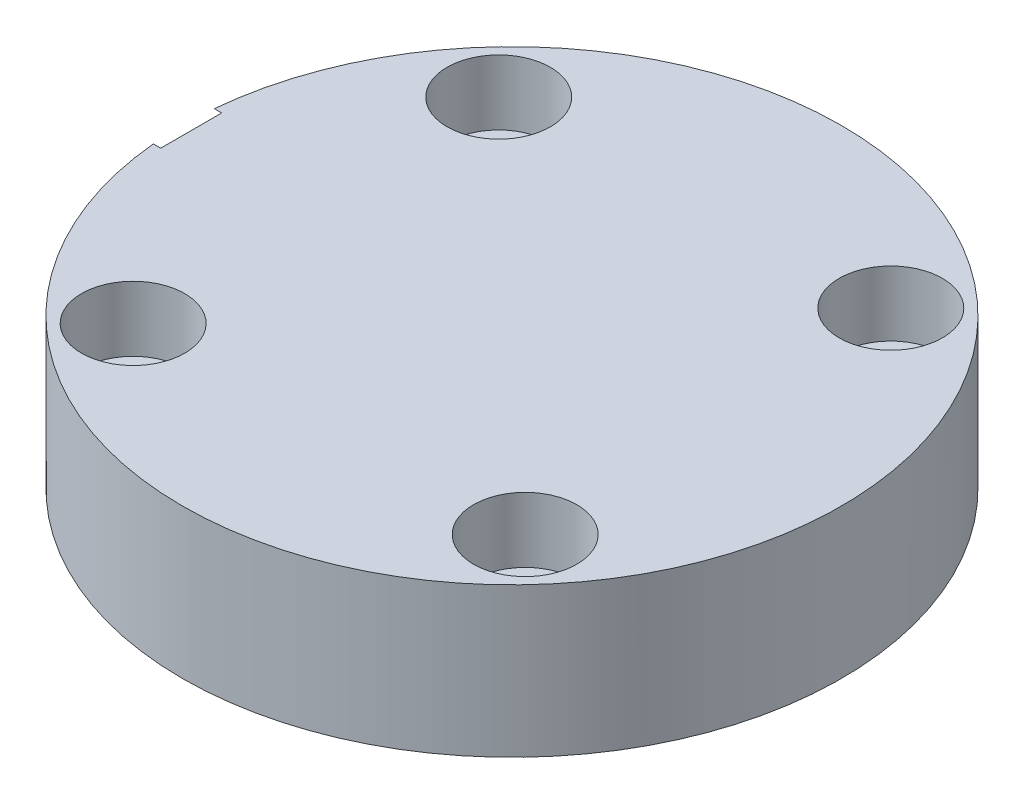
ISO-10303-21;
HEADER;
FILE_DESCRIPTION(('STEP AP214'),'2;1');
FILE_NAME('part.step','',(''),(''),'','','');
FILE_SCHEMA(('AUTOMOTIVE_DESIGN { 1 0 10303 214 1 1 1 1 }'));
ENDSEC;
DATA;
#1=APPLICATION_CONTEXT('core data for automotive mechanical design processes');
#2=APPLICATION_PROTOCOL_DEFINITION('international standard','automotive_design',2000,#1);
#3=PRODUCT_CONTEXT('',#1,'mechanical');
#4=PRODUCT('Part','Part','',(#3));
#5=PRODUCT_RELATED_PRODUCT_CATEGORY('part','',(#4));
#6=PRODUCT_DEFINITION_FORMATION('','',#4);
#7=PRODUCT_DEFINITION_CONTEXT('part definition',#1,'design');
#8=PRODUCT_DEFINITION('design','',#6,#7);
#9=PRODUCT_DEFINITION_SHAPE('','',#8);
#10=(LENGTH_UNIT() NAMED_UNIT(*) SI_UNIT(.MILLI.,.METRE.));
#11=(NAMED_UNIT(*) PLANE_ANGLE_UNIT() SI_UNIT($,.RADIAN.));
#12=(NAMED_UNIT(*) SI_UNIT($,.STERADIAN.) SOLID_ANGLE_UNIT());
#13=UNCERTAINTY_MEASURE_WITH_UNIT(LENGTH_MEASURE(1.E-05),#10,'distance_accuracy_value','');
#14=(GEOMETRIC_REPRESENTATION_CONTEXT(3) GLOBAL_UNCERTAINTY_ASSIGNED_CONTEXT((#13)) GLOBAL_UNIT_ASSIGNED_CONTEXT((#10,
#11,#12)) REPRESENTATION_CONTEXT('',''));
#15=CARTESIAN_POINT('',(0.,0.,0.));
#16=DIRECTION('',(0.,0.,1.));
#17=DIRECTION('',(1.,0.,0.));
#18=AXIS2_PLACEMENT_3D('',#15,#16,#17);
#19=CARTESIAN_POINT('',(0.,8.636,0.));
#20=DIRECTION('',(0.,-1.,0.));
#21=DIRECTION('',(0.,0.,-1.));
#22=AXIS2_PLACEMENT_3D('',#19,#20,#21);
#23=PLANE('',#22);
#24=CARTESIAN_POINT('',(-11.331594252887,8.636,-10.566882590808));
#25=DIRECTION('',(0.,1.,0.));
#26=DIRECTION('',(0.,0.,1.));
#27=AXIS2_PLACEMENT_3D('',#24,#25,#26);
#28=CIRCLE('',#27,2.98450000000001);
#29=CARTESIAN_POINT('',(-11.331594252887,8.636,-7.58238259080798));
#30=VERTEX_POINT('',#29);
#31=EDGE_CURVE('E101',#30,#30,#28,.T.);
#32=ORIENTED_EDGE('',*,*,#31,.F.);
#33=EDGE_LOOP('',(#32));
#34=FACE_BOUND('',#33,.T.);
#35=CARTESIAN_POINT('',(10.566882590808,8.636,-11.331594252887));
#36=DIRECTION('',(0.,1.,0.));
#37=DIRECTION('',(0.,0.,1.));
#38=AXIS2_PLACEMENT_3D('',#35,#36,#37);
#39=CIRCLE('',#38,2.98450000000001);
#40=CARTESIAN_POINT('',(10.566882590808,8.636,-8.34709425288698));
#41=VERTEX_POINT('',#40);
#42=EDGE_CURVE('E116',#41,#41,#39,.T.);
#43=ORIENTED_EDGE('',*,*,#42,.F.);
#44=EDGE_LOOP('',(#43));
#45=FACE_BOUND('',#44,.T.);
#46=CARTESIAN_POINT('',(11.331594252887,8.636,10.566882590808));
#47=DIRECTION('',(0.,1.,0.));
#48=DIRECTION('',(0.,0.,1.));
#49=AXIS2_PLACEMENT_3D('',#46,#47,#48);
#50=CIRCLE('',#49,2.98450000000001);
#51=CARTESIAN_POINT('',(11.331594252887,8.636,13.551382590808));
#52=VERTEX_POINT('',#51);
#53=EDGE_CURVE('E128',#52,#52,#50,.T.);
#54=ORIENTED_EDGE('',*,*,#53,.F.);
#55=EDGE_LOOP('',(#54));
#56=FACE_BOUND('',#55,.T.);
#57=CARTESIAN_POINT('',(-10.566882590808,8.636,11.331594252887));
#58=DIRECTION('',(0.,1.,0.));
#59=DIRECTION('',(0.,0.,1.));
#60=AXIS2_PLACEMENT_3D('',#57,#58,#59);
#61=CIRCLE('',#60,2.98450000000001);
#62=CARTESIAN_POINT('',(-10.566882590808,8.636,14.316094252887));
#63=VERTEX_POINT('',#62);
#64=EDGE_CURVE('E140',#63,#63,#61,.T.);
#65=ORIENTED_EDGE('',*,*,#64,.F.);
#66=EDGE_LOOP('',(#65));
#67=FACE_BOUND('',#66,.T.);
#68=DIRECTION('',(-1.,0.,0.));
#69=VECTOR('',#68,1.);
#70=CARTESIAN_POINT('',(-6.7286871769978,8.636,1.76233951397));
#71=LINE('',#70,#69);
#72=CARTESIAN_POINT('',(-18.968306709812,8.636,1.76233951397));
#73=VERTEX_POINT('',#72);
#74=CARTESIAN_POINT('',(-18.542,8.636,1.76233951397));
#75=VERTEX_POINT('',#74);
#76=EDGE_CURVE('E164',#73,#75,#71,.F.);
#77=ORIENTED_EDGE('',*,*,#76,.F.);
#78=CARTESIAN_POINT('',(0.,8.636,0.));
#79=DIRECTION('',(0.,1.,0.));
#80=DIRECTION('',(0.,0.,1.));
#81=AXIS2_PLACEMENT_3D('',#78,#79,#80);
#82=CIRCLE('',#81,19.05);
#83=CARTESIAN_POINT('',(-18.968306709812,8.636,-1.76233951397));
#84=VERTEX_POINT('',#83);
#85=EDGE_CURVE('E169',#73,#84,#82,.T.);
#86=ORIENTED_EDGE('',*,*,#85,.T.);
#87=DIRECTION('',(-1.,0.,0.));
#88=VECTOR('',#87,1.);
#89=CARTESIAN_POINT('',(-6.7286871769978,8.636,-1.76233951397));
#90=LINE('',#89,#88);
#91=CARTESIAN_POINT('',(-18.542,8.636,-1.76233951397));
#92=VERTEX_POINT('',#91);
#93=EDGE_CURVE('E162',#92,#84,#90,.T.);
#94=ORIENTED_EDGE('',*,*,#93,.F.);
#95=DIRECTION('',(0.,0.,-1.));
#96=VECTOR('',#95,1.);
#97=CARTESIAN_POINT('',(-18.542,8.636,0.));
#98=LINE('',#97,#96);
#99=EDGE_CURVE('E177',#75,#92,#98,.T.);
#100=ORIENTED_EDGE('',*,*,#99,.F.);
#101=EDGE_LOOP('',(#77,#86,#94,#100));
#102=FACE_BOUND('',#101,.T.);
#103=ADVANCED_FACE('F38',(#34,#45,#56,#67,#102),#23,.F.);
#104=CARTESIAN_POINT('',(0.,0.,0.));
#105=DIRECTION('',(0.,1.,0.));
#106=DIRECTION('',(0.,0.,1.));
#107=AXIS2_PLACEMENT_3D('',#104,#105,#106);
#108=CYLINDRICAL_SURFACE('',#107,19.05);
#109=CARTESIAN_POINT('',(0.,0.,0.));
#110=DIRECTION('',(0.,1.,0.));
#111=DIRECTION('',(0.,0.,1.));
#112=AXIS2_PLACEMENT_3D('',#109,#110,#111);
#113=CIRCLE('',#112,19.05);
#114=CARTESIAN_POINT('',(0.,0.,19.05));
#115=VERTEX_POINT('',#114);
#116=EDGE_CURVE('E166',#115,#115,#113,.T.);
#117=ORIENTED_EDGE('',*,*,#116,.T.);
#118=EDGE_LOOP('',(#117));
#119=FACE_BOUND('',#118,.T.);
#120=CARTESIAN_POINT('',(-18.968306709812,8.636,-1.76233951397));
#121=CARTESIAN_POINT('',(-18.958973143008,8.58619641595596,-1.86285332701888));
#122=CARTESIAN_POINT('',(-18.9490255242818,8.53214126342431,-1.96119268943215));
#123=CARTESIAN_POINT('',(-18.9282036775732,8.41596585477278,-2.15286953737453));
#124=CARTESIAN_POINT('',(-18.9173295472481,8.3538464482893,-2.24620754837621));
#125=CARTESIAN_POINT('',(-18.8949595211944,8.22200196483473,-2.4272061282805));
#126=CARTESIAN_POINT('',(-18.8834639304195,8.15228060140373,-2.51486943620446));
#127=CARTESIAN_POINT('',(-18.8601743041453,8.00573018806637,-2.68395474043862));
#128=CARTESIAN_POINT('',(-18.8483802664707,7.92890108633972,-2.76537669123713));
#129=CARTESIAN_POINT('',(-18.8130415561964,7.68846180985587,-2.99947333836041));
#130=CARTESIAN_POINT('',(-18.7895254061489,7.51481561237189,-3.14209397921449));
#131=CARTESIAN_POINT('',(-18.7452876715468,7.14586200820587,-3.39608674481463));
#132=CARTESIAN_POINT('',(-18.7245654930498,6.95055922141972,-3.50746551641281));
#133=CARTESIAN_POINT('',(-18.6883165743046,6.54375495856327,-3.6957459443969));
#134=CARTESIAN_POINT('',(-18.6727839928002,6.33227202628185,-3.77268639690454));
#135=CARTESIAN_POINT('',(-18.64873941695,5.89896331077316,-3.88981257071471));
#136=CARTESIAN_POINT('',(-18.640227320372,5.6771376782058,-3.92999882723204));
#137=CARTESIAN_POINT('',(-18.6313484869153,5.23405341146186,-3.97187670625916));
#138=CARTESIAN_POINT('',(-18.630827607966,5.01286657184159,-3.97429681334053));
#139=CARTESIAN_POINT('',(-18.6375957868141,4.57329670753198,-3.94243342513674));
#140=CARTESIAN_POINT('',(-18.6448840815895,4.35491341102258,-3.9081535157523));
#141=CARTESIAN_POINT('',(-18.6663197260181,3.92896342125705,-3.80443821890758));
#142=CARTESIAN_POINT('',(-18.6804097045272,3.72132205758918,-3.73529667073165));
#143=CARTESIAN_POINT('',(-18.7138264053601,3.32053739830261,-3.56409411206283));
#144=CARTESIAN_POINT('',(-18.733153726959,3.12739576502529,-3.46202933412462));
#145=CARTESIAN_POINT('',(-18.7752479826415,2.75778087062878,-3.22600499179433));
#146=CARTESIAN_POINT('',(-18.7980642002181,2.58161727621635,-3.09156937565959));
#147=CARTESIAN_POINT('',(-18.8443863772706,2.25409951155382,-2.79535805108399));
#148=CARTESIAN_POINT('',(-18.8678924048525,2.10274780080019,-2.63357963549202));
#149=CARTESIAN_POINT('',(-18.913379767912,1.82680767384406,-2.2842937266163));
#150=CARTESIAN_POINT('',(-18.9353322468822,1.70266453239125,-2.09643020667183));
#151=CARTESIAN_POINT('',(-18.9748428716231,1.48773836687204,-1.7020724594519));
#152=CARTESIAN_POINT('',(-18.9924012780855,1.39695336358146,-1.49557933842436));
#153=CARTESIAN_POINT('',(-19.0210138401898,1.25214555516241,-1.07157371465098));
#154=CARTESIAN_POINT('',(-19.0321210406746,1.1978223505717,-0.854167524451744));
#155=CARTESIAN_POINT('',(-19.0467981758083,1.12649038306393,-0.413078038693404));
#156=CARTESIAN_POINT('',(-19.0503690791397,1.10947682451792,-0.189395553607289));
#157=CARTESIAN_POINT('',(-19.0495772317718,1.11328085877481,0.253484204795391));
#158=CARTESIAN_POINT('',(-19.0453597540993,1.13340572109987,0.472688033727692));
#159=CARTESIAN_POINT('',(-19.0297412457593,1.2094834061704,0.904513423398371));
#160=CARTESIAN_POINT('',(-19.0183402156396,1.26543622618358,1.11713498463872));
#161=CARTESIAN_POINT('',(-18.9896018543378,1.41141158594472,1.52981412386955));
#162=CARTESIAN_POINT('',(-18.9722664470846,1.50142308484162,1.72987574895449));
#163=CARTESIAN_POINT('',(-18.9335185849823,1.71289875322803,2.11218894646345));
#164=CARTESIAN_POINT('',(-18.912105668448,1.83436648498182,2.29443849853567));
#165=CARTESIAN_POINT('',(-18.867069513541,2.10791786285438,2.63951874170536));
#166=CARTESIAN_POINT('',(-18.8434130803625,2.26051957816156,2.80193455206637));
#167=CARTESIAN_POINT('',(-18.7968362957805,2.59078196332187,3.09905069849851));
#168=CARTESIAN_POINT('',(-18.7739160022984,2.76844459913091,3.23374885816074));
#169=CARTESIAN_POINT('',(-18.7311738195718,3.14589046356831,3.47283296916353));
#170=CARTESIAN_POINT('',(-18.7113836082402,3.3458687287423,3.57691717489517));
#171=CARTESIAN_POINT('',(-18.6774913752077,3.76095608566634,3.74988482460711));
#172=CARTESIAN_POINT('',(-18.6633886160861,3.97606321159627,3.81877283234714));
#173=CARTESIAN_POINT('',(-18.642721210832,4.41200351153388,3.91842106231878));
#174=CARTESIAN_POINT('',(-18.6360503439418,4.63270862748064,3.9497190619254));
#175=CARTESIAN_POINT('',(-18.6306834804124,5.07634105591598,3.9749607463178));
#176=CARTESIAN_POINT('',(-18.6319870207985,5.29926823864658,3.96890659967758));
#177=CARTESIAN_POINT('',(-18.6423242175272,5.73719962728297,3.92005548210126));
#178=CARTESIAN_POINT('',(-18.6512326241226,5.9522736511782,3.87785381182771));
#179=CARTESIAN_POINT('',(-18.6755815307074,6.37220346109661,3.75883035614601));
#180=CARTESIAN_POINT('',(-18.6910216176735,6.5770598923021,3.68201075974282));
#181=CARTESIAN_POINT('',(-18.7268288487942,6.97254820054594,3.49534714819804));
#182=CARTESIAN_POINT('',(-18.747232847204,7.16305902726109,3.38525454475525));
#183=CARTESIAN_POINT('',(-18.7906601126224,7.52323240535834,3.13522029138339));
#184=CARTESIAN_POINT('',(-18.813684081736,7.69288934281656,2.9952706314703));
#185=CARTESIAN_POINT('',(-18.8485141610752,7.92978317919434,2.76446204775276));
#186=CARTESIAN_POINT('',(-18.860294644806,8.00650320524893,2.68310649950865));
#187=CARTESIAN_POINT('',(-18.8835569249808,8.15284989075131,2.51416862108585));
#188=CARTESIAN_POINT('',(-18.8950387179518,8.22247646774784,2.42658621854891));
#189=CARTESIAN_POINT('',(-18.9173832403401,8.35415509563139,2.24575212905131));
#190=CARTESIAN_POINT('',(-18.9282455913533,8.41620254246069,2.15249704714791));
#191=CARTESIAN_POINT('',(-18.9490451981353,8.53224822268096,1.96099811666389));
#192=CARTESIAN_POINT('',(-18.9589823730027,8.58624575240042,1.86275383296477));
#193=CARTESIAN_POINT('',(-18.968306709812,8.636,1.76233951396999));
#194=B_SPLINE_CURVE_WITH_KNOTS('',3,(#120,#121,#122,#123,#124,#125,#126,#127,#128,#129,#130,
#131,#132,#133,#134,#135,#136,#137,#138,#139,#140,#141,#142,#143,#144,#145,#146,#147,#148,#149,
#150,#151,#152,#153,#154,#155,#156,#157,#158,#159,#160,#161,#162,#163,#164,#165,#166,#167,#168,
#169,#170,#171,#172,#173,#174,#175,#176,#177,#178,#179,#180,#181,#182,#183,#184,#185,#186,#187,
#188,#189,#190,#191,#192,#193),.UNSPECIFIED.,.F.,.F.,(4,2,2,2,2,2,2,2,2,2,2,2,2,2,2,2,2,2,2,2,2,
2,2,2,2,2,2,2,2,2,2,2,2,2,2,2,4),(0.,0.337572816039461,0.675110094788698,1.01248321982203,
1.34985880473057,2.02418534569581,2.69836831156711,3.37178986038956,4.04520160268767,
4.70560725445807,5.36594838492269,6.02081446457129,6.67575550794353,7.3409896625001,
8.00628971906775,8.6817766310788,9.35722345823893,10.0270348103806,10.6967600626695,
11.3541192135724,12.0114783143439,12.6686245003811,13.3258451375725,13.9950546571899,
14.6643167035624,15.3399697793772,16.0155352235287,16.6813160341803,17.3470581915947,
18.0020427558191,18.6569859090326,19.31694857332,19.9770885140546,20.3140905703442,
20.6510965433565,20.9883062282828,21.3255453726298),.UNSPECIFIED.);
#195=EDGE_CURVE('E64',#84,#73,#194,.T.);
#196=ORIENTED_EDGE('',*,*,#195,.F.);
#197=ORIENTED_EDGE('',*,*,#85,.F.);
#198=EDGE_LOOP('',(#196,#197));
#199=FACE_BOUND('',#198,.T.);
#200=ADVANCED_FACE('F178',(#119,#199),#108,.T.);
#201=CARTESIAN_POINT('',(19.05,0.,0.));
#202=DIRECTION('',(0.,1.,0.));
#203=DIRECTION('',(0.,0.,1.));
#204=AXIS2_PLACEMENT_3D('',#201,#202,#203);
#205=PLANE('',#204);
#206=CARTESIAN_POINT('',(-4.1405913989565,0.,-14.930490242014));
#207=DIRECTION('',(0.,-1.,0.));
#208=DIRECTION('',(0.,0.,-1.));
#209=AXIS2_PLACEMENT_3D('',#206,#207,#208);
#210=CIRCLE('',#209,1.72720000000001);
#211=CARTESIAN_POINT('',(-4.1405913989565,0.,-16.657690242014));
#212=VERTEX_POINT('',#211);
#213=EDGE_CURVE('E560',#212,#212,#210,.T.);
#214=ORIENTED_EDGE('',*,*,#213,.F.);
#215=EDGE_LOOP('',(#214));
#216=FACE_BOUND('',#215,.T.);
#217=CARTESIAN_POINT('',(14.930490242014,0.,-4.1405913989565));
#218=DIRECTION('',(0.,-1.,0.));
#219=DIRECTION('',(0.,0.,-1.));
#220=AXIS2_PLACEMENT_3D('',#217,#218,#219);
#221=CIRCLE('',#220,1.72720000000002);
#222=CARTESIAN_POINT('',(14.930490242014,0.,-5.86779139895652));
#223=VERTEX_POINT('',#222);
#224=EDGE_CURVE('E562',#223,#223,#221,.T.);
#225=ORIENTED_EDGE('',*,*,#224,.F.);
#226=EDGE_LOOP('',(#225));
#227=FACE_BOUND('',#226,.T.);
#228=CARTESIAN_POINT('',(4.1405913989565,0.,14.930490242014));
#229=DIRECTION('',(0.,-1.,0.));
#230=DIRECTION('',(0.,0.,-1.));
#231=AXIS2_PLACEMENT_3D('',#228,#229,#230);
#232=CIRCLE('',#231,1.72720000000001);
#233=CARTESIAN_POINT('',(4.1405913989565,0.,13.203290242014));
#234=VERTEX_POINT('',#233);
#235=EDGE_CURVE('E570',#234,#234,#232,.T.);
#236=ORIENTED_EDGE('',*,*,#235,.F.);
#237=EDGE_LOOP('',(#236));
#238=FACE_BOUND('',#237,.T.);
#239=CARTESIAN_POINT('',(-14.930490242014,0.,4.1405913989565));
#240=DIRECTION('',(0.,-1.,0.));
#241=DIRECTION('',(0.,0.,-1.));
#242=AXIS2_PLACEMENT_3D('',#239,#240,#241);
#243=CIRCLE('',#242,1.72720000000001);
#244=CARTESIAN_POINT('',(-14.930490242014,0.,2.41339139895649));
#245=VERTEX_POINT('',#244);
#246=EDGE_CURVE('E576',#245,#245,#243,.T.);
#247=ORIENTED_EDGE('',*,*,#246,.F.);
#248=EDGE_LOOP('',(#247));
#249=FACE_BOUND('',#248,.T.);
#250=CARTESIAN_POINT('',(0.,0.,0.));
#251=DIRECTION('',(0.,-1.,0.));
#252=DIRECTION('',(0.,0.,-1.));
#253=AXIS2_PLACEMENT_3D('',#250,#251,#252);
#254=CIRCLE('',#253,10.3124);
#255=CARTESIAN_POINT('',(0.,0.,-10.3124));
#256=VERTEX_POINT('',#255);
#257=EDGE_CURVE('E93',#256,#256,#254,.T.);
#258=ORIENTED_EDGE('',*,*,#257,.F.);
#259=EDGE_LOOP('',(#258));
#260=FACE_BOUND('',#259,.T.);
#261=CARTESIAN_POINT('',(-11.331594252887,0.,-10.566882590808));
#262=DIRECTION('',(0.,1.,0.));
#263=DIRECTION('',(0.,0.,1.));
#264=AXIS2_PLACEMENT_3D('',#261,#262,#263);
#265=CIRCLE('',#264,1.98120000000001);
#266=CARTESIAN_POINT('',(-11.331594252887,0.,-8.58568259080799));
#267=VERTEX_POINT('',#266);
#268=EDGE_CURVE('E113',#267,#267,#265,.T.);
#269=ORIENTED_EDGE('',*,*,#268,.T.);
#270=EDGE_LOOP('',(#269));
#271=FACE_BOUND('',#270,.T.);
#272=CARTESIAN_POINT('',(10.566882590808,0.,-11.331594252887));
#273=DIRECTION('',(0.,1.,0.));
#274=DIRECTION('',(0.,0.,1.));
#275=AXIS2_PLACEMENT_3D('',#272,#273,#274);
#276=CIRCLE('',#275,1.98120000000001);
#277=CARTESIAN_POINT('',(10.566882590808,0.,-9.35039425288699));
#278=VERTEX_POINT('',#277);
#279=EDGE_CURVE('E125',#278,#278,#276,.T.);
#280=ORIENTED_EDGE('',*,*,#279,.T.);
#281=EDGE_LOOP('',(#280));
#282=FACE_BOUND('',#281,.T.);
#283=CARTESIAN_POINT('',(11.331594252887,0.,10.566882590808));
#284=DIRECTION('',(0.,1.,0.));
#285=DIRECTION('',(0.,0.,1.));
#286=AXIS2_PLACEMENT_3D('',#283,#284,#285);
#287=CIRCLE('',#286,1.98120000000001);
#288=CARTESIAN_POINT('',(11.331594252887,0.,12.548082590808));
#289=VERTEX_POINT('',#288);
#290=EDGE_CURVE('E137',#289,#289,#287,.T.);
#291=ORIENTED_EDGE('',*,*,#290,.T.);
#292=EDGE_LOOP('',(#291));
#293=FACE_BOUND('',#292,.T.);
#294=CARTESIAN_POINT('',(-10.566882590808,0.,11.331594252887));
#295=DIRECTION('',(0.,1.,0.));
#296=DIRECTION('',(0.,0.,1.));
#297=AXIS2_PLACEMENT_3D('',#294,#295,#296);
#298=CIRCLE('',#297,1.98120000000001);
#299=CARTESIAN_POINT('',(-10.566882590808,0.,13.312794252887));
#300=VERTEX_POINT('',#299);
#301=EDGE_CURVE('E149',#300,#300,#298,.T.);
#302=ORIENTED_EDGE('',*,*,#301,.T.);
#303=EDGE_LOOP('',(#302));
#304=FACE_BOUND('',#303,.T.);
#305=ORIENTED_EDGE('',*,*,#116,.F.);
#306=EDGE_LOOP('',(#305));
#307=FACE_BOUND('',#306,.T.);
#308=ADVANCED_FACE('F189',(#216,#227,#238,#249,#260,#271,#282,#293,#304,#307),#205,.F.);
#309=CARTESIAN_POINT('',(-18.542,9.04875,0.));
#310=DIRECTION('',(-1.,0.,0.));
#311=DIRECTION('',(0.,0.,1.));
#312=AXIS2_PLACEMENT_3D('',#309,#310,#311);
#313=PLANE('',#312);
#314=CARTESIAN_POINT('',(-18.542,5.08,0.));
#315=DIRECTION('',(-1.,0.,0.));
#316=DIRECTION('',(0.,0.,1.));
#317=AXIS2_PLACEMENT_3D('',#314,#315,#316);
#318=CIRCLE('',#317,2.413);
#319=CARTESIAN_POINT('',(-18.542,5.08,2.413));
#320=VERTEX_POINT('',#319);
#321=EDGE_CURVE('E156',#320,#320,#318,.T.);
#322=ORIENTED_EDGE('',*,*,#321,.F.);
#323=EDGE_LOOP('',(#322));
#324=FACE_BOUND('',#323,.T.);
#325=ORIENTED_EDGE('',*,*,#99,.T.);
#326=CARTESIAN_POINT('',(-18.542,5.08,0.));
#327=DIRECTION('',(-1.,0.,0.));
#328=DIRECTION('',(0.,0.,1.));
#329=AXIS2_PLACEMENT_3D('',#326,#327,#328);
#330=CIRCLE('',#329,3.96875);
#331=EDGE_CURVE('E159',#92,#75,#330,.T.);
#332=ORIENTED_EDGE('',*,*,#331,.T.);
#333=EDGE_LOOP('',(#325,#332));
#334=FACE_BOUND('',#333,.T.);
#335=ADVANCED_FACE('F186',(#324,#334),#313,.T.);
#336=CARTESIAN_POINT('',(-6.7286871769978,5.08,0.));
#337=DIRECTION('',(-1.,0.,0.));
#338=DIRECTION('',(0.,0.,1.));
#339=AXIS2_PLACEMENT_3D('',#336,#337,#338);
#340=CYLINDRICAL_SURFACE('',#339,3.96875);
#341=ORIENTED_EDGE('',*,*,#76,.T.);
#342=ORIENTED_EDGE('',*,*,#331,.F.);
#343=ORIENTED_EDGE('',*,*,#93,.T.);
#344=ORIENTED_EDGE('',*,*,#195,.T.);
#345=EDGE_LOOP('',(#341,#342,#343,#344));
#346=FACE_BOUND('',#345,.T.);
#347=ADVANCED_FACE('F181',(#346),#340,.F.);
#348=CARTESIAN_POINT('',(-18.11274,5.08,0.));
#349=DIRECTION('',(-1.,0.,0.));
#350=DIRECTION('',(0.,0.,1.));
#351=AXIS2_PLACEMENT_3D('',#348,#349,#350);
#352=CONICAL_SURFACE('',#351,1.98374,0.785398163397443);
#353=ORIENTED_EDGE('',*,*,#321,.T.);
#354=EDGE_LOOP('',(#353));
#355=FACE_BOUND('',#354,.T.);
#356=CARTESIAN_POINT('',(-18.11274,5.08,0.));
#357=DIRECTION('',(-1.,0.,0.));
#358=DIRECTION('',(0.,0.,1.));
#359=AXIS2_PLACEMENT_3D('',#356,#357,#358);
#360=CIRCLE('',#359,1.98374);
#361=CARTESIAN_POINT('',(-18.11274,5.08,1.98374));
#362=VERTEX_POINT('',#361);
#363=EDGE_CURVE('E153',#362,#362,#360,.T.);
#364=ORIENTED_EDGE('',*,*,#363,.F.);
#365=EDGE_LOOP('',(#364));
#366=FACE_BOUND('',#365,.T.);
#367=ADVANCED_FACE('F185',(#355,#366),#352,.F.);
#368=CARTESIAN_POINT('',(-6.7286871769978,5.08,0.));
#369=DIRECTION('',(-1.,0.,0.));
#370=DIRECTION('',(0.,0.,1.));
#371=AXIS2_PLACEMENT_3D('',#368,#369,#370);
#372=CYLINDRICAL_SURFACE('',#371,1.98374);
#373=DIRECTION('',(-1.,0.,0.));
#374=VECTOR('',#373,1.);
#375=CARTESIAN_POINT('',(-6.7286871769978,4.318,-1.831551360896));
#376=LINE('',#375,#374);
#377=CARTESIAN_POINT('',(-7.874,4.318,-1.831551360896));
#378=VERTEX_POINT('',#377);
#379=CARTESIAN_POINT('',(-10.1484488160704,4.318,-1.831551360896));
#380=VERTEX_POINT('',#379);
#381=EDGE_CURVE('E92',#378,#380,#376,.T.);
#382=ORIENTED_EDGE('',*,*,#381,.F.);
#383=CARTESIAN_POINT('',(-7.874,5.08,0.));
#384=DIRECTION('',(-1.,0.,0.));
#385=DIRECTION('',(0.,0.,1.));
#386=AXIS2_PLACEMENT_3D('',#383,#384,#385);
#387=CIRCLE('',#386,1.98374);
#388=CARTESIAN_POINT('',(-7.874,4.318,1.831551360896));
#389=VERTEX_POINT('',#388);
#390=EDGE_CURVE('E99',#389,#378,#387,.T.);
#391=ORIENTED_EDGE('',*,*,#390,.F.);
#392=DIRECTION('',(-1.,0.,0.));
#393=VECTOR('',#392,1.);
#394=CARTESIAN_POINT('',(-6.7286871769978,4.318,1.831551360896));
#395=LINE('',#394,#393);
#396=CARTESIAN_POINT('',(-10.1484488160704,4.318,1.831551360896));
#397=VERTEX_POINT('',#396);
#398=EDGE_CURVE('E57',#397,#389,#395,.F.);
#399=ORIENTED_EDGE('',*,*,#398,.F.);
#400=CARTESIAN_POINT('',(-10.1484488160704,4.318,-1.831551360896));
#401=CARTESIAN_POINT('',(-10.1523307295266,4.26627741997668,-1.81003212563262));
#402=CARTESIAN_POINT('',(-10.15653749903,4.21551387213309,-1.78634128802486));
#403=CARTESIAN_POINT('',(-10.1654720150666,4.11621010978478,-1.7347813101553));
#404=CARTESIAN_POINT('',(-10.1701997016872,4.06766964050244,-1.70691265026827));
#405=CARTESIAN_POINT('',(-10.1849570570044,3.92597187191448,-1.61737304930524));
#406=CARTESIAN_POINT('',(-10.1955740427077,3.83657361776582,-1.54969974576053));
#407=CARTESIAN_POINT('',(-10.2171581892262,3.67047336798419,-1.4003405696009));
#408=CARTESIAN_POINT('',(-10.2281254202562,3.59377393742459,-1.31865187274376));
#409=CARTESIAN_POINT('',(-10.2491864676427,3.45514512602281,-1.14347585732608));
#410=CARTESIAN_POINT('',(-10.2592804042456,3.39321370966328,-1.04999016749801));
#411=CARTESIAN_POINT('',(-10.2774852960261,3.28579964890034,-0.853593190312656));
#412=CARTESIAN_POINT('',(-10.2855925327254,3.24034777394584,-0.750664716279645));
#413=CARTESIAN_POINT('',(-10.2988824125913,3.16743537675203,-0.538430418401745));
#414=CARTESIAN_POINT('',(-10.3040650614484,3.13997481950688,-0.429124606965743));
#415=CARTESIAN_POINT('',(-10.3108620074707,3.10419314226036,-0.208966054624752));
#416=CARTESIAN_POINT('',(-10.3125275777648,3.09559693772033,-0.0981595874973861));
#417=CARTESIAN_POINT('',(-10.3122570681654,3.09700288063558,0.123326019492643));
#418=CARTESIAN_POINT('',(-10.3103212299676,3.10700378001201,0.234005167401086));
#419=CARTESIAN_POINT('',(-10.3031028254861,3.14508450537033,0.450921697192623));
#420=CARTESIAN_POINT('',(-10.2978545354904,3.17297921917175,0.557192830172797));
#421=CARTESIAN_POINT('',(-10.2846156137339,3.24581777185274,0.76352576055836));
#422=CARTESIAN_POINT('',(-10.2766250787238,3.29076100924007,0.863587776883882));
#423=CARTESIAN_POINT('',(-10.258674292042,3.39691372158332,1.05574956711831));
#424=CARTESIAN_POINT('',(-10.2486958336015,3.45827549792353,1.14776349728511));
#425=CARTESIAN_POINT('',(-10.2279021946964,3.59534570125691,1.32029409940203));
#426=CARTESIAN_POINT('',(-10.2170868413332,3.67105709752548,1.40080838574683));
#427=CARTESIAN_POINT('',(-10.1956355812196,3.83606527298908,1.54930006696661));
#428=CARTESIAN_POINT('',(-10.185004621706,3.92554476283416,1.61707660247916));
#429=CARTESIAN_POINT('',(-10.170227729714,4.06738572977835,1.70674650905111));
#430=CARTESIAN_POINT('',(-10.1654936100975,4.11597948240959,1.73465534615503));
#431=CARTESIAN_POINT('',(-10.156547364646,4.21539483525796,1.78628567346737));
#432=CARTESIAN_POINT('',(-10.152335292131,4.266216662326,1.81000673605668));
#433=CARTESIAN_POINT('',(-10.1484488160704,4.318,1.831551360896));
#434=B_SPLINE_CURVE_WITH_KNOTS('',3,(#400,#401,#402,#403,#404,#405,#406,#407,#408,#409,#410,
#411,#412,#413,#414,#415,#416,#417,#418,#419,#420,#421,#422,#423,#424,#425,#426,#427,#428,#429,
#430,#431,#432,#433),.UNSPECIFIED.,.F.,.F.,(4,2,2,2,2,2,2,2,2,2,2,2,2,2,2,2,4),(0.,
0.168357652079968,0.336695960870138,0.672842913717333,1.00905768327299,1.34522608457076,
1.68201896246432,2.01881118505528,2.35065864720445,2.6824838393889,3.01093046505153,
3.33936550380318,3.67095964884576,4.00262248361132,4.33914225790787,4.50767980160798,
4.67623454495431),.UNSPECIFIED.);
#435=EDGE_CURVE('E11',#380,#397,#434,.T.);
#436=ORIENTED_EDGE('',*,*,#435,.F.);
#437=EDGE_LOOP('',(#382,#391,#399,#436));
#438=FACE_BOUND('',#437,.T.);
#439=ORIENTED_EDGE('',*,*,#363,.T.);
#440=EDGE_LOOP('',(#439));
#441=FACE_BOUND('',#440,.T.);
#442=ADVANCED_FACE('F96',(#438,#441),#372,.F.);
#443=CARTESIAN_POINT('',(-6.7286871769978,5.08,0.));
#444=DIRECTION('',(-1.,0.,0.));
#445=DIRECTION('',(0.,0.,1.));
#446=AXIS2_PLACEMENT_3D('',#443,#444,#445);
#447=CONICAL_SURFACE('',#446,0.,1.04719755119661);
#448=CARTESIAN_POINT('',(-12.6421139007186,4.318,-10.213970963854));
#449=CARTESIAN_POINT('',(-12.4351985762305,4.318,-9.85457870393848));
#450=CARTESIAN_POINT('',(-12.2283217443316,4.318,-9.49516426201814));
#451=CARTESIAN_POINT('',(-11.8146913046481,4.318,-8.77625231538468));
#452=CARTESIAN_POINT('',(-11.6079377001314,4.318,-8.41675480879139));
#453=CARTESIAN_POINT('',(-11.1944703469547,4.318,-7.69741250361712));
#454=CARTESIAN_POINT('',(-10.9877567203897,4.318,-7.33756763484117));
#455=CARTESIAN_POINT('',(-10.5746126076001,4.318,-6.61772722359467));
#456=CARTESIAN_POINT('',(-10.3681821144916,4.318,-6.25773168507549));
#457=CARTESIAN_POINT('',(-9.95968768248123,4.318,-5.54432516436904));
#458=CARTESIAN_POINT('',(-9.7576152953929,4.318,-5.19091902366824));
#459=CARTESIAN_POINT('',(-9.45508854476997,4.318,-4.66046012056801));
#460=CARTESIAN_POINT('',(-9.35433945859024,4.318,-4.48357549314924));
#461=CARTESIAN_POINT('',(-9.15312349013212,4.318,-4.12964739051578));
#462=CARTESIAN_POINT('',(-9.05265660588798,4.318,-3.95260391641896));
#463=CARTESIAN_POINT('',(-8.85217689368765,4.318,-3.59836307780746));
#464=CARTESIAN_POINT('',(-8.7521638847271,4.318,-3.42116581584852));
#465=CARTESIAN_POINT('',(-8.5527722333675,4.318,-3.06640835218995));
#466=CARTESIAN_POINT('',(-8.45339360819812,4.318,-2.88884814080419));
#467=CARTESIAN_POINT('',(-8.25569086620411,4.318,-2.53316994336678));
#468=CARTESIAN_POINT('',(-8.1573666103218,4.318,-2.35505203497316));
#469=CARTESIAN_POINT('',(-8.01135221073934,4.318,-2.0870773161165));
#470=CARTESIAN_POINT('',(-7.96292711572625,4.318,-1.99762139485185));
#471=CARTESIAN_POINT('',(-7.86679067570531,4.318,-1.81832726244078));
#472=CARTESIAN_POINT('',(-7.81907931934931,4.318,-1.72848905740174));
#473=CARTESIAN_POINT('',(-7.75164591941841,4.318,-1.5996726107599));
#474=CARTESIAN_POINT('',(-7.73148704362812,4.318,-1.56092319454405));
#475=CARTESIAN_POINT('',(-7.69141219775997,4.318,-1.48329891447636));
#476=CARTESIAN_POINT('',(-7.67149622876682,4.318,-1.44442405006531));
#477=CARTESIAN_POINT('',(-7.61217846805923,4.318,-1.32756086398001));
#478=CARTESIAN_POINT('',(-7.5732143840617,4.318,-1.24934830841128));
#479=CARTESIAN_POINT('',(-7.49676835109029,4.318,-1.09136559578504));
#480=CARTESIAN_POINT('',(-7.45930208277983,4.318,-1.01158782282272));
#481=CARTESIAN_POINT('',(-7.38738900371223,4.318,-0.850676102364784));
#482=CARTESIAN_POINT('',(-7.35294123694426,4.318,-0.76954259401793));
#483=CARTESIAN_POINT('',(-7.30317665827933,4.318,-0.640816563498246));
#484=CARTESIAN_POINT('',(-7.28604113454907,4.318,-0.593934432476263));
#485=CARTESIAN_POINT('',(-7.25419840967685,4.318,-0.499324486855883));
#486=CARTESIAN_POINT('',(-7.23949180795117,4.318,-0.451596466714829));
#487=CARTESIAN_POINT('',(-7.21364476751895,4.318,-0.355900729456645));
#488=CARTESIAN_POINT('',(-7.20245583275983,4.318,-0.307946460135938));
#489=CARTESIAN_POINT('',(-7.18445827247465,4.318,-0.211241815614579));
#490=CARTESIAN_POINT('',(-7.17764522572811,4.318,-0.162492295145519));
#491=CARTESIAN_POINT('',(-7.16923706949777,4.318,-0.0635555869989507));
#492=CARTESIAN_POINT('',(-7.16774716946068,4.318,-0.0133589764877027));
#493=CARTESIAN_POINT('',(-7.17053193272296,4.318,0.0868676607141179));
#494=CARTESIAN_POINT('',(-7.17480689626077,4.318,0.13689767859238));
#495=CARTESIAN_POINT('',(-7.18853359149269,4.318,0.23693206662842));
#496=CARTESIAN_POINT('',(-7.19805782767698,4.318,0.286926025586966));
#497=CARTESIAN_POINT('',(-7.22114911055427,4.318,0.385970530157994));
#498=CARTESIAN_POINT('',(-7.23471860328534,4.318,0.435020485803884));
#499=CARTESIAN_POINT('',(-7.26220680227894,4.318,0.523870930408153));
#500=CARTESIAN_POINT('',(-7.27566758464519,4.318,0.563816660237934));
#501=CARTESIAN_POINT('',(-7.30411224466066,4.318,0.643165589828908));
#502=CARTESIAN_POINT('',(-7.319096393719,4.318,0.682568691488377));
#503=CARTESIAN_POINT('',(-7.36577415959805,4.318,0.800167302979322));
#504=CARTESIAN_POINT('',(-7.39917003182975,4.318,0.87768253419516));
#505=CARTESIAN_POINT('',(-7.46866871424788,4.318,1.03167685732469));
#506=CARTESIAN_POINT('',(-7.50477760774375,4.318,1.10815313749119));
#507=CARTESIAN_POINT('',(-7.57865356032206,4.318,1.26030760505141));
#508=CARTESIAN_POINT('',(-7.61642079782666,4.318,1.33598570547683));
#509=CARTESIAN_POINT('',(-7.69330093674508,4.318,1.48730960930964));
#510=CARTESIAN_POINT('',(-7.73242132665138,4.318,1.5629515848614));
#511=CARTESIAN_POINT('',(-7.81141799334021,4.318,1.71385053953797));
#512=CARTESIAN_POINT('',(-7.85129436072968,4.318,1.78910747112342));
#513=CARTESIAN_POINT('',(-7.9315064038357,4.318,1.93919616192109));
#514=CARTESIAN_POINT('',(-7.97184109032818,4.318,2.01402845086503));
#515=CARTESIAN_POINT('',(-8.05290081774711,4.318,2.16347708157934));
#516=CARTESIAN_POINT('',(-8.09362584258058,4.318,2.23809343208874));
#517=CARTESIAN_POINT('',(-8.21566811559389,4.318,2.46066290011916));
#518=CARTESIAN_POINT('',(-8.29741453639969,4.318,2.60838053669604));
#519=CARTESIAN_POINT('',(-8.4616059373687,4.318,2.90342727021811));
#520=CARTESIAN_POINT('',(-8.54405092211104,4.318,3.05075636460807));
#521=CARTESIAN_POINT('',(-8.79206408310924,4.318,3.49237483842664));
#522=CARTESIAN_POINT('',(-8.95830526108325,4.318,3.78628600645929));
#523=CARTESIAN_POINT('',(-9.2917988261787,4.318,4.37387322521028));
#524=CARTESIAN_POINT('',(-9.45905197177339,4.318,4.66754884419255));
#525=CARTESIAN_POINT('',(-9.79406105253118,4.318,5.25460738334324));
#526=CARTESIAN_POINT('',(-9.96181698015204,4.318,5.54799030781523));
#527=CARTESIAN_POINT('',(-10.2901353069629,4.318,6.12146967356499));
#528=CARTESIAN_POINT('',(-10.4506841167621,4.318,6.40157390027894));
#529=CARTESIAN_POINT('',(-10.7719751602492,4.318,6.96167322782821));
#530=CARTESIAN_POINT('',(-10.9327173948855,4.318,7.24166832811954));
#531=CARTESIAN_POINT('',(-11.2541887183236,4.318,7.80132333583189));
#532=CARTESIAN_POINT('',(-11.4149176830248,4.318,8.08098331455169));
#533=CARTESIAN_POINT('',(-11.736475660895,4.318,8.64024380941628));
#534=CARTESIAN_POINT('',(-11.8973046735379,4.318,8.91984432586356));
#535=CARTESIAN_POINT('',(-12.0581672569026,4.318,9.19942551284107));
#536=B_SPLINE_CURVE_WITH_KNOTS('',3,(#448,#449,#450,#451,#452,#453,#454,#455,#456,#457,#458,
#459,#460,#461,#462,#463,#464,#465,#466,#467,#468,#469,#470,#471,#472,#473,#474,#475,#476,#477,
#478,#479,#480,#481,#482,#483,#484,#485,#486,#487,#488,#489,#490,#491,#492,#493,#494,#495,#496,
#497,#498,#499,#500,#501,#502,#503,#504,#505,#506,#507,#508,#509,#510,#511,#512,#513,#514,#515,
#516,#517,#518,#519,#520,#521,#522,#523,#524,#525,#526,#527,#528,#529,#530,#531,#532,#533,#534,
#535),.UNSPECIFIED.,.F.,.F.,(4,2,2,2,2,2,2,2,2,2,2,2,2,2,2,2,2,2,2,2,2,2,2,2,2,2,2,2,2,2,2,2,2,
2,2,2,2,2,2,2,2,2,2,4),(0.,1.24410240310473,2.48823644978931,3.73321414117173,4.97816100628882,
6.19945569407865,6.81014933367831,7.42083870875262,8.03125826094575,8.64169432199573,
9.25204885897906,9.55721280746405,9.86237189879484,9.99340953968278,10.1244477655121,
10.386572898609,10.6509587011265,10.9152604631971,11.0649614390119,11.214699303436,
11.3622717503738,11.5096948605442,11.6600160793269,11.8103451272546,11.9628045771778,
12.115356402118,12.2417783999647,12.3682229612649,12.621331599279,12.8750257597623,
13.1287472825462,13.3842199484574,13.6397234298318,13.8947529558077,14.1497720122002,
14.6562530416899,15.1627373937604,16.175738337263,17.1896269841333,18.2035004970342,
19.1720605335987,20.1406253382922,21.108298575083,22.0759667653459),.UNSPECIFIED.);
#537=EDGE_CURVE('E50',#389,#378,#536,.F.);
#538=ORIENTED_EDGE('',*,*,#537,.F.);
#539=ORIENTED_EDGE('',*,*,#390,.T.);
#540=EDGE_LOOP('',(#538,#539));
#541=FACE_BOUND('',#540,.T.);
#542=CARTESIAN_POINT('',(-6.7286871769978,5.08,0.));
#543=VERTEX_POINT('',#542);
#544=VERTEX_LOOP('',#543);
#545=FACE_BOUND('',#544,.T.);
#546=ADVANCED_FACE('F224',(#541,#545),#447,.F.);
#547=CARTESIAN_POINT('',(-10.566882590808,8.636,11.331594252887));
#548=DIRECTION('',(0.,1.,0.));
#549=DIRECTION('',(0.,0.,1.));
#550=AXIS2_PLACEMENT_3D('',#547,#548,#549);
#551=CYLINDRICAL_SURFACE('',#550,1.98120000000001);
#552=ORIENTED_EDGE('',*,*,#301,.F.);
#553=EDGE_LOOP('',(#552));
#554=FACE_BOUND('',#553,.T.);
#555=CARTESIAN_POINT('',(-10.566882590808,4.8768,11.331594252887));
#556=DIRECTION('',(0.,1.,0.));
#557=DIRECTION('',(0.,0.,1.));
#558=AXIS2_PLACEMENT_3D('',#555,#556,#557);
#559=CIRCLE('',#558,1.98120000000001);
#560=CARTESIAN_POINT('',(-10.566882590808,4.8768,13.312794252887));
#561=VERTEX_POINT('',#560);
#562=EDGE_CURVE('E146',#561,#561,#559,.T.);
#563=ORIENTED_EDGE('',*,*,#562,.T.);
#564=EDGE_LOOP('',(#563));
#565=FACE_BOUND('',#564,.T.);
#566=ADVANCED_FACE('F228',(#554,#565),#551,.F.);
#567=CARTESIAN_POINT('',(-8.58568259080798,4.8768,11.331594252887));
#568=DIRECTION('',(0.,-1.,0.));
#569=DIRECTION('',(0.,0.,-1.));
#570=AXIS2_PLACEMENT_3D('',#567,#568,#569);
#571=PLANE('',#570);
#572=ORIENTED_EDGE('',*,*,#562,.F.);
#573=EDGE_LOOP('',(#572));
#574=FACE_BOUND('',#573,.T.);
#575=CARTESIAN_POINT('',(-10.566882590808,4.8768,11.331594252887));
#576=DIRECTION('',(0.,1.,0.));
#577=DIRECTION('',(0.,0.,1.));
#578=AXIS2_PLACEMENT_3D('',#575,#576,#577);
#579=CIRCLE('',#578,2.98450000000001);
#580=CARTESIAN_POINT('',(-10.566882590808,4.8768,14.316094252887));
#581=VERTEX_POINT('',#580);
#582=EDGE_CURVE('E143',#581,#581,#579,.T.);
#583=ORIENTED_EDGE('',*,*,#582,.T.);
#584=EDGE_LOOP('',(#583));
#585=FACE_BOUND('',#584,.T.);
#586=ADVANCED_FACE('F261',(#574,#585),#571,.F.);
#587=CARTESIAN_POINT('',(-10.566882590808,8.636,11.331594252887));
#588=DIRECTION('',(0.,1.,0.));
#589=DIRECTION('',(0.,0.,1.));
#590=AXIS2_PLACEMENT_3D('',#587,#588,#589);
#591=CYLINDRICAL_SURFACE('',#590,2.98450000000001);
#592=ORIENTED_EDGE('',*,*,#582,.F.);
#593=EDGE_LOOP('',(#592));
#594=FACE_BOUND('',#593,.T.);
#595=ORIENTED_EDGE('',*,*,#64,.T.);
#596=EDGE_LOOP('',(#595));
#597=FACE_BOUND('',#596,.T.);
#598=ADVANCED_FACE('F270',(#594,#597),#591,.F.);
#599=CARTESIAN_POINT('',(11.331594252887,8.636,10.566882590808));
#600=DIRECTION('',(0.,1.,0.));
#601=DIRECTION('',(0.,0.,1.));
#602=AXIS2_PLACEMENT_3D('',#599,#600,#601);
#603=CYLINDRICAL_SURFACE('',#602,1.98120000000001);
#604=ORIENTED_EDGE('',*,*,#290,.F.);
#605=EDGE_LOOP('',(#604));
#606=FACE_BOUND('',#605,.T.);
#607=CARTESIAN_POINT('',(11.331594252887,4.8768,10.566882590808));
#608=DIRECTION('',(0.,1.,0.));
#609=DIRECTION('',(0.,0.,1.));
#610=AXIS2_PLACEMENT_3D('',#607,#608,#609);
#611=CIRCLE('',#610,1.98120000000001);
#612=CARTESIAN_POINT('',(11.331594252887,4.8768,12.548082590808));
#613=VERTEX_POINT('',#612);
#614=EDGE_CURVE('E134',#613,#613,#611,.T.);
#615=ORIENTED_EDGE('',*,*,#614,.T.);
#616=EDGE_LOOP('',(#615));
#617=FACE_BOUND('',#616,.T.);
#618=ADVANCED_FACE('F279',(#606,#617),#603,.F.);
#619=CARTESIAN_POINT('',(13.312794252887,4.8768,10.566882590808));
#620=DIRECTION('',(0.,-1.,0.));
#621=DIRECTION('',(0.,0.,-1.));
#622=AXIS2_PLACEMENT_3D('',#619,#620,#621);
#623=PLANE('',#622);
#624=ORIENTED_EDGE('',*,*,#614,.F.);
#625=EDGE_LOOP('',(#624));
#626=FACE_BOUND('',#625,.T.);
#627=CARTESIAN_POINT('',(11.331594252887,4.8768,10.566882590808));
#628=DIRECTION('',(0.,1.,0.));
#629=DIRECTION('',(0.,0.,1.));
#630=AXIS2_PLACEMENT_3D('',#627,#628,#629);
#631=CIRCLE('',#630,2.98450000000001);
#632=CARTESIAN_POINT('',(11.331594252887,4.8768,13.551382590808));
#633=VERTEX_POINT('',#632);
#634=EDGE_CURVE('E131',#633,#633,#631,.T.);
#635=ORIENTED_EDGE('',*,*,#634,.T.);
#636=EDGE_LOOP('',(#635));
#637=FACE_BOUND('',#636,.T.);
#638=ADVANCED_FACE('F287',(#626,#637),#623,.F.);
#639=CARTESIAN_POINT('',(11.331594252887,8.636,10.566882590808));
#640=DIRECTION('',(0.,1.,0.));
#641=DIRECTION('',(0.,0.,1.));
#642=AXIS2_PLACEMENT_3D('',#639,#640,#641);
#643=CYLINDRICAL_SURFACE('',#642,2.98450000000001);
#644=ORIENTED_EDGE('',*,*,#634,.F.);
#645=EDGE_LOOP('',(#644));
#646=FACE_BOUND('',#645,.T.);
#647=ORIENTED_EDGE('',*,*,#53,.T.);
#648=EDGE_LOOP('',(#647));
#649=FACE_BOUND('',#648,.T.);
#650=ADVANCED_FACE('F295',(#646,#649),#643,.F.);
#651=CARTESIAN_POINT('',(10.566882590808,8.636,-11.331594252887));
#652=DIRECTION('',(0.,1.,0.));
#653=DIRECTION('',(0.,0.,1.));
#654=AXIS2_PLACEMENT_3D('',#651,#652,#653);
#655=CYLINDRICAL_SURFACE('',#654,1.98120000000001);
#656=ORIENTED_EDGE('',*,*,#279,.F.);
#657=EDGE_LOOP('',(#656));
#658=FACE_BOUND('',#657,.T.);
#659=CARTESIAN_POINT('',(10.566882590808,4.8768,-11.331594252887));
#660=DIRECTION('',(0.,1.,0.));
#661=DIRECTION('',(0.,0.,1.));
#662=AXIS2_PLACEMENT_3D('',#659,#660,#661);
#663=CIRCLE('',#662,1.98120000000001);
#664=CARTESIAN_POINT('',(10.566882590808,4.8768,-9.35039425288699));
#665=VERTEX_POINT('',#664);
#666=EDGE_CURVE('E122',#665,#665,#663,.T.);
#667=ORIENTED_EDGE('',*,*,#666,.T.);
#668=EDGE_LOOP('',(#667));
#669=FACE_BOUND('',#668,.T.);
#670=ADVANCED_FACE('F303',(#658,#669),#655,.F.);
#671=CARTESIAN_POINT('',(12.548082590808,4.8768,-11.331594252887));
#672=DIRECTION('',(0.,-1.,0.));
#673=DIRECTION('',(0.,0.,-1.));
#674=AXIS2_PLACEMENT_3D('',#671,#672,#673);
#675=PLANE('',#674);
#676=ORIENTED_EDGE('',*,*,#666,.F.);
#677=EDGE_LOOP('',(#676));
#678=FACE_BOUND('',#677,.T.);
#679=CARTESIAN_POINT('',(10.566882590808,4.8768,-11.331594252887));
#680=DIRECTION('',(0.,1.,0.));
#681=DIRECTION('',(0.,0.,1.));
#682=AXIS2_PLACEMENT_3D('',#679,#680,#681);
#683=CIRCLE('',#682,2.98450000000001);
#684=CARTESIAN_POINT('',(10.566882590808,4.8768,-8.34709425288698));
#685=VERTEX_POINT('',#684);
#686=EDGE_CURVE('E119',#685,#685,#683,.T.);
#687=ORIENTED_EDGE('',*,*,#686,.T.);
#688=EDGE_LOOP('',(#687));
#689=FACE_BOUND('',#688,.T.);
#690=ADVANCED_FACE('F311',(#678,#689),#675,.F.);
#691=CARTESIAN_POINT('',(10.566882590808,8.636,-11.331594252887));
#692=DIRECTION('',(0.,1.,0.));
#693=DIRECTION('',(0.,0.,1.));
#694=AXIS2_PLACEMENT_3D('',#691,#692,#693);
#695=CYLINDRICAL_SURFACE('',#694,2.98450000000001);
#696=ORIENTED_EDGE('',*,*,#686,.F.);
#697=EDGE_LOOP('',(#696));
#698=FACE_BOUND('',#697,.T.);
#699=ORIENTED_EDGE('',*,*,#42,.T.);
#700=EDGE_LOOP('',(#699));
#701=FACE_BOUND('',#700,.T.);
#702=ADVANCED_FACE('F320',(#698,#701),#695,.F.);
#703=CARTESIAN_POINT('',(-11.331594252887,8.636,-10.566882590808));
#704=DIRECTION('',(0.,1.,0.));
#705=DIRECTION('',(0.,0.,1.));
#706=AXIS2_PLACEMENT_3D('',#703,#704,#705);
#707=CYLINDRICAL_SURFACE('',#706,1.98120000000001);
#708=ORIENTED_EDGE('',*,*,#268,.F.);
#709=EDGE_LOOP('',(#708));
#710=FACE_BOUND('',#709,.T.);
#711=CARTESIAN_POINT('',(-11.331594252887,4.8768,-10.566882590808));
#712=DIRECTION('',(0.,1.,0.));
#713=DIRECTION('',(0.,0.,1.));
#714=AXIS2_PLACEMENT_3D('',#711,#712,#713);
#715=CIRCLE('',#714,1.98120000000001);
#716=CARTESIAN_POINT('',(-11.331594252887,4.8768,-8.58568259080798));
#717=VERTEX_POINT('',#716);
#718=EDGE_CURVE('E110',#717,#717,#715,.T.);
#719=ORIENTED_EDGE('',*,*,#718,.T.);
#720=EDGE_LOOP('',(#719));
#721=FACE_BOUND('',#720,.T.);
#722=ADVANCED_FACE('F328',(#710,#721),#707,.F.);
#723=CARTESIAN_POINT('',(-9.35039425288699,4.8768,-10.566882590808));
#724=DIRECTION('',(0.,-1.,0.));
#725=DIRECTION('',(0.,0.,-1.));
#726=AXIS2_PLACEMENT_3D('',#723,#724,#725);
#727=PLANE('',#726);
#728=ORIENTED_EDGE('',*,*,#718,.F.);
#729=EDGE_LOOP('',(#728));
#730=FACE_BOUND('',#729,.T.);
#731=CARTESIAN_POINT('',(-11.331594252887,4.8768,-10.566882590808));
#732=DIRECTION('',(0.,1.,0.));
#733=DIRECTION('',(0.,0.,1.));
#734=AXIS2_PLACEMENT_3D('',#731,#732,#733);
#735=CIRCLE('',#734,2.98450000000001);
#736=CARTESIAN_POINT('',(-11.331594252887,4.8768,-7.58238259080798));
#737=VERTEX_POINT('',#736);
#738=EDGE_CURVE('E107',#737,#737,#735,.T.);
#739=ORIENTED_EDGE('',*,*,#738,.T.);
#740=EDGE_LOOP('',(#739));
#741=FACE_BOUND('',#740,.T.);
#742=ADVANCED_FACE('F335',(#730,#741),#727,.F.);
#743=CARTESIAN_POINT('',(-11.331594252887,8.636,-10.566882590808));
#744=DIRECTION('',(0.,1.,0.));
#745=DIRECTION('',(0.,0.,1.));
#746=AXIS2_PLACEMENT_3D('',#743,#744,#745);
#747=CYLINDRICAL_SURFACE('',#746,2.98450000000001);
#748=ORIENTED_EDGE('',*,*,#738,.F.);
#749=EDGE_LOOP('',(#748));
#750=FACE_BOUND('',#749,.T.);
#751=ORIENTED_EDGE('',*,*,#31,.T.);
#752=EDGE_LOOP('',(#751));
#753=FACE_BOUND('',#752,.T.);
#754=ADVANCED_FACE('F342',(#750,#753),#747,.F.);
#755=CARTESIAN_POINT('',(0.,4.318,0.));
#756=DIRECTION('',(0.,1.,0.));
#757=DIRECTION('',(0.,0.,1.));
#758=AXIS2_PLACEMENT_3D('',#755,#756,#757);
#759=PLANE('',#758);
#760=ORIENTED_EDGE('',*,*,#381,.T.);
#761=CARTESIAN_POINT('',(0.,4.318,0.));
#762=DIRECTION('',(0.,-1.,0.));
#763=DIRECTION('',(0.,0.,-1.));
#764=AXIS2_PLACEMENT_3D('',#761,#762,#763);
#765=CIRCLE('',#764,10.3124);
#766=EDGE_CURVE('E88',#380,#397,#765,.T.);
#767=ORIENTED_EDGE('',*,*,#766,.T.);
#768=ORIENTED_EDGE('',*,*,#398,.T.);
#769=ORIENTED_EDGE('',*,*,#537,.T.);
#770=EDGE_LOOP('',(#760,#767,#768,#769));
#771=FACE_BOUND('',#770,.T.);
#772=ADVANCED_FACE('F91',(#771),#759,.F.);
#773=CARTESIAN_POINT('',(0.,0.,0.));
#774=DIRECTION('',(0.,-1.,0.));
#775=DIRECTION('',(0.,0.,-1.));
#776=AXIS2_PLACEMENT_3D('',#773,#774,#775);
#777=CYLINDRICAL_SURFACE('',#776,10.3124);
#778=ORIENTED_EDGE('',*,*,#435,.T.);
#779=ORIENTED_EDGE('',*,*,#766,.F.);
#780=EDGE_LOOP('',(#778,#779));
#781=FACE_BOUND('',#780,.T.);
#782=ORIENTED_EDGE('',*,*,#257,.T.);
#783=EDGE_LOOP('',(#782));
#784=FACE_BOUND('',#783,.T.);
#785=ADVANCED_FACE('F86',(#781,#784),#777,.F.);
#786=CARTESIAN_POINT('',(-14.930490242014,4.318,4.1405913989565));
#787=DIRECTION('',(0.,1.,0.));
#788=DIRECTION('',(0.,0.,1.));
#789=AXIS2_PLACEMENT_3D('',#786,#787,#788);
#790=PLANE('',#789);
#791=CARTESIAN_POINT('',(-14.930490242014,4.318,4.1405913989565));
#792=DIRECTION('',(0.,-1.,0.));
#793=DIRECTION('',(0.,0.,-1.));
#794=AXIS2_PLACEMENT_3D('',#791,#792,#793);
#795=CIRCLE('',#794,1.72720000000001);
#796=CARTESIAN_POINT('',(-14.930490242014,4.318,2.41339139895649));
#797=VERTEX_POINT('',#796);
#798=EDGE_CURVE('E579',#797,#797,#795,.T.);
#799=ORIENTED_EDGE('',*,*,#798,.T.);
#800=EDGE_LOOP('',(#799));
#801=FACE_BOUND('',#800,.T.);
#802=ADVANCED_FACE('F362',(#801),#790,.F.);
#803=CARTESIAN_POINT('',(-14.930490242014,0.,4.1405913989565));
#804=DIRECTION('',(0.,-1.,0.));
#805=DIRECTION('',(0.,0.,-1.));
#806=AXIS2_PLACEMENT_3D('',#803,#804,#805);
#807=CYLINDRICAL_SURFACE('',#806,1.72720000000001);
#808=ORIENTED_EDGE('',*,*,#798,.F.);
#809=EDGE_LOOP('',(#808));
#810=FACE_BOUND('',#809,.T.);
#811=ORIENTED_EDGE('',*,*,#246,.T.);
#812=EDGE_LOOP('',(#811));
#813=FACE_BOUND('',#812,.T.);
#814=ADVANCED_FACE('F367',(#810,#813),#807,.F.);
#815=CARTESIAN_POINT('',(4.1405913989565,4.318,14.930490242014));
#816=DIRECTION('',(0.,1.,0.));
#817=DIRECTION('',(0.,0.,1.));
#818=AXIS2_PLACEMENT_3D('',#815,#816,#817);
#819=PLANE('',#818);
#820=CARTESIAN_POINT('',(4.1405913989565,4.318,14.930490242014));
#821=DIRECTION('',(0.,-1.,0.));
#822=DIRECTION('',(0.,0.,-1.));
#823=AXIS2_PLACEMENT_3D('',#820,#821,#822);
#824=CIRCLE('',#823,1.72720000000001);
#825=CARTESIAN_POINT('',(4.1405913989565,4.318,13.203290242014));
#826=VERTEX_POINT('',#825);
#827=EDGE_CURVE('E573',#826,#826,#824,.T.);
#828=ORIENTED_EDGE('',*,*,#827,.T.);
#829=EDGE_LOOP('',(#828));
#830=FACE_BOUND('',#829,.T.);
#831=ADVANCED_FACE('F374',(#830),#819,.F.);
#832=CARTESIAN_POINT('',(4.1405913989565,0.,14.930490242014));
#833=DIRECTION('',(0.,-1.,0.));
#834=DIRECTION('',(0.,0.,-1.));
#835=AXIS2_PLACEMENT_3D('',#832,#833,#834);
#836=CYLINDRICAL_SURFACE('',#835,1.72720000000001);
#837=ORIENTED_EDGE('',*,*,#827,.F.);
#838=EDGE_LOOP('',(#837));
#839=FACE_BOUND('',#838,.T.);
#840=ORIENTED_EDGE('',*,*,#235,.T.);
#841=EDGE_LOOP('',(#840));
#842=FACE_BOUND('',#841,.T.);
#843=ADVANCED_FACE('F381',(#839,#842),#836,.F.);
#844=CARTESIAN_POINT('',(14.930490242014,4.318,-4.1405913989565));
#845=DIRECTION('',(0.,1.,0.));
#846=DIRECTION('',(0.,0.,1.));
#847=AXIS2_PLACEMENT_3D('',#844,#845,#846);
#848=PLANE('',#847);
#849=CARTESIAN_POINT('',(14.930490242014,4.318,-4.1405913989565));
#850=DIRECTION('',(0.,-1.,0.));
#851=DIRECTION('',(0.,0.,-1.));
#852=AXIS2_PLACEMENT_3D('',#849,#850,#851);
#853=CIRCLE('',#852,1.72720000000002);
#854=CARTESIAN_POINT('',(14.930490242014,4.318,-5.86779139895652));
#855=VERTEX_POINT('',#854);
#856=EDGE_CURVE('E567',#855,#855,#853,.T.);
#857=ORIENTED_EDGE('',*,*,#856,.T.);
#858=EDGE_LOOP('',(#857));
#859=FACE_BOUND('',#858,.T.);
#860=ADVANCED_FACE('F388',(#859),#848,.F.);
#861=CARTESIAN_POINT('',(14.930490242014,0.,-4.1405913989565));
#862=DIRECTION('',(0.,-1.,0.));
#863=DIRECTION('',(0.,0.,-1.));
#864=AXIS2_PLACEMENT_3D('',#861,#862,#863);
#865=CYLINDRICAL_SURFACE('',#864,1.72720000000002);
#866=ORIENTED_EDGE('',*,*,#856,.F.);
#867=EDGE_LOOP('',(#866));
#868=FACE_BOUND('',#867,.T.);
#869=ORIENTED_EDGE('',*,*,#224,.T.);
#870=EDGE_LOOP('',(#869));
#871=FACE_BOUND('',#870,.T.);
#872=ADVANCED_FACE('F396',(#868,#871),#865,.F.);
#873=CARTESIAN_POINT('',(-4.1405913989565,4.318,-14.930490242014));
#874=DIRECTION('',(0.,1.,0.));
#875=DIRECTION('',(0.,0.,1.));
#876=AXIS2_PLACEMENT_3D('',#873,#874,#875);
#877=PLANE('',#876);
#878=CARTESIAN_POINT('',(-4.1405913989565,4.318,-14.930490242014));
#879=DIRECTION('',(0.,-1.,0.));
#880=DIRECTION('',(0.,0.,-1.));
#881=AXIS2_PLACEMENT_3D('',#878,#879,#880);
#882=CIRCLE('',#881,1.72720000000001);
#883=CARTESIAN_POINT('',(-4.1405913989565,4.318,-16.657690242014));
#884=VERTEX_POINT('',#883);
#885=EDGE_CURVE('E558',#884,#884,#882,.T.);
#886=ORIENTED_EDGE('',*,*,#885,.T.);
#887=EDGE_LOOP('',(#886));
#888=FACE_BOUND('',#887,.T.);
#889=ADVANCED_FACE('F403',(#888),#877,.F.);
#890=CARTESIAN_POINT('',(-4.1405913989565,0.,-14.930490242014));
#891=DIRECTION('',(0.,-1.,0.));
#892=DIRECTION('',(0.,0.,-1.));
#893=AXIS2_PLACEMENT_3D('',#890,#891,#892);
#894=CYLINDRICAL_SURFACE('',#893,1.72720000000001);
#895=ORIENTED_EDGE('',*,*,#885,.F.);
#896=EDGE_LOOP('',(#895));
#897=FACE_BOUND('',#896,.T.);
#898=ORIENTED_EDGE('',*,*,#213,.T.);
#899=EDGE_LOOP('',(#898));
#900=FACE_BOUND('',#899,.T.);
#901=ADVANCED_FACE('F410',(#897,#900),#894,.F.);
#902=CLOSED_SHELL('',(#103,#200,#308,#335,#347,#367,#442,#546,#566,#586,#598,#618,#638,#650,
#670,#690,#702,#722,#742,#754,#772,#785,#802,#814,#831,#843,#860,#872,#889,#901));
#903=MANIFOLD_SOLID_BREP('B2',#902);
#904=ADVANCED_BREP_SHAPE_REPRESENTATION('',(#18,#903),#14);
#905=SHAPE_DEFINITION_REPRESENTATION(#9,#904);
ENDSEC;
END-ISO-10303-21;
